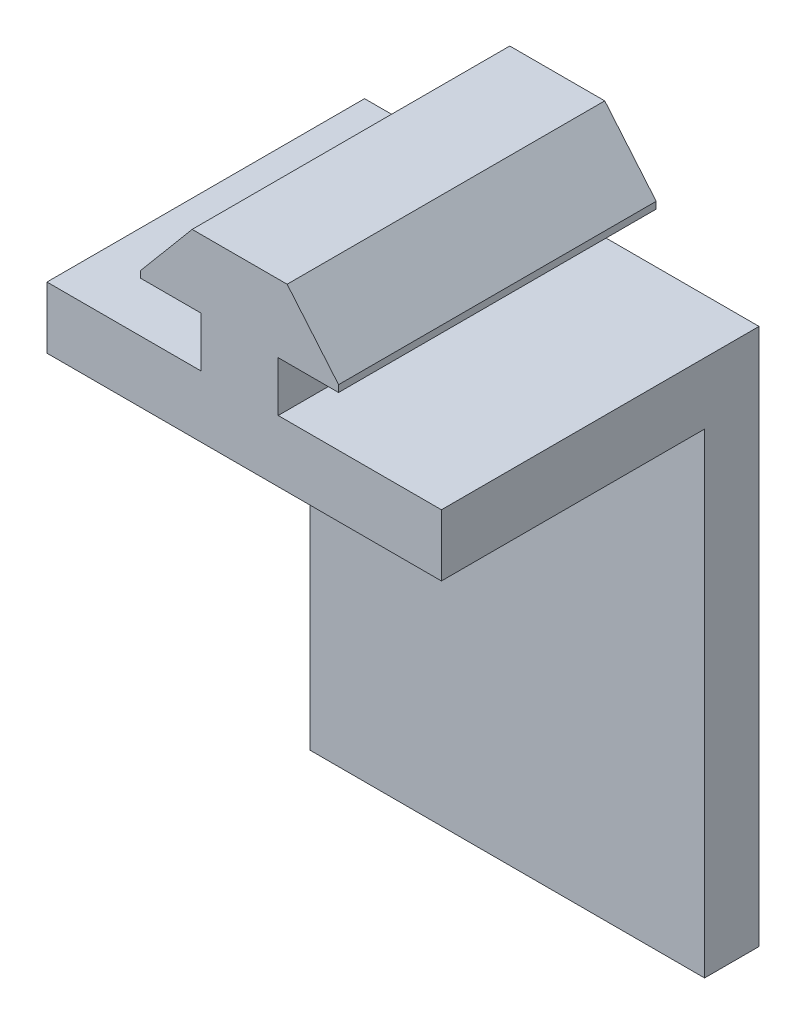
ISO-10303-21;
HEADER;
FILE_DESCRIPTION(('STEP AP214'),'2;1');
FILE_NAME('part.step','',(''),(''),'','','');
FILE_SCHEMA(('AUTOMOTIVE_DESIGN { 1 0 10303 214 1 1 1 1 }'));
ENDSEC;
DATA;
#1=APPLICATION_CONTEXT('core data for automotive mechanical design processes');
#2=APPLICATION_PROTOCOL_DEFINITION('international standard','automotive_design',2000,#1);
#3=PRODUCT_CONTEXT('',#1,'mechanical');
#4=PRODUCT('Part','Part','',(#3));
#5=PRODUCT_RELATED_PRODUCT_CATEGORY('part','',(#4));
#6=PRODUCT_DEFINITION_FORMATION('','',#4);
#7=PRODUCT_DEFINITION_CONTEXT('part definition',#1,'design');
#8=PRODUCT_DEFINITION('design','',#6,#7);
#9=PRODUCT_DEFINITION_SHAPE('','',#8);
#10=(LENGTH_UNIT() NAMED_UNIT(*) SI_UNIT(.MILLI.,.METRE.));
#11=(NAMED_UNIT(*) PLANE_ANGLE_UNIT() SI_UNIT($,.RADIAN.));
#12=(NAMED_UNIT(*) SI_UNIT($,.STERADIAN.) SOLID_ANGLE_UNIT());
#13=UNCERTAINTY_MEASURE_WITH_UNIT(LENGTH_MEASURE(1.E-05),#10,'distance_accuracy_value','');
#14=(GEOMETRIC_REPRESENTATION_CONTEXT(3) GLOBAL_UNCERTAINTY_ASSIGNED_CONTEXT((#13)) GLOBAL_UNIT_ASSIGNED_CONTEXT((#10,
#11,#12)) REPRESENTATION_CONTEXT('',''));
#15=CARTESIAN_POINT('',(0.,0.,0.));
#16=DIRECTION('',(0.,0.,1.));
#17=DIRECTION('',(1.,0.,0.));
#18=AXIS2_PLACEMENT_3D('',#15,#16,#17);
#19=CARTESIAN_POINT('',(19.95,2.794,415.2));
#20=DIRECTION('',(-1.,0.,0.));
#21=DIRECTION('',(0.,-1.,0.));
#22=AXIS2_PLACEMENT_3D('',#19,#20,#21);
#23=PLANE('',#22);
#24=DIRECTION('',(0.,0.,-1.));
#25=VECTOR('',#24,1.);
#26=CARTESIAN_POINT('',(19.95,-37.206,432.8));
#27=LINE('',#26,#25);
#28=CARTESIAN_POINT('',(19.95,-37.206,374.2));
#29=VERTEX_POINT('',#28);
#30=CARTESIAN_POINT('',(19.95,-37.206,342.8));
#31=VERTEX_POINT('',#30);
#32=EDGE_CURVE('E45',#29,#31,#27,.T.);
#33=ORIENTED_EDGE('',*,*,#32,.F.);
#34=DIRECTION('',(0.,-1.,0.));
#35=VECTOR('',#34,1.);
#36=CARTESIAN_POINT('',(19.95,2.794,374.2));
#37=LINE('',#36,#35);
#38=CARTESIAN_POINT('',(19.95,-43.302,374.2));
#39=VERTEX_POINT('',#38);
#40=EDGE_CURVE('E59',#29,#39,#37,.T.);
#41=ORIENTED_EDGE('',*,*,#40,.T.);
#42=DIRECTION('',(0.,0.,-1.));
#43=VECTOR('',#42,1.);
#44=CARTESIAN_POINT('',(19.95,-43.302,457.2));
#45=LINE('',#44,#43);
#46=CARTESIAN_POINT('',(19.95,-43.302,348.186168039582));
#47=VERTEX_POINT('',#46);
#48=EDGE_CURVE('E215',#39,#47,#45,.T.);
#49=ORIENTED_EDGE('',*,*,#48,.T.);
#50=DIRECTION('',(0.,1.,0.));
#51=VECTOR('',#50,1.);
#52=CARTESIAN_POINT('',(19.95,-90.302,348.186168039582));
#53=LINE('',#52,#51);
#54=CARTESIAN_POINT('',(19.95,-90.302,348.186168039582));
#55=VERTEX_POINT('',#54);
#56=EDGE_CURVE('E184',#55,#47,#53,.T.);
#57=ORIENTED_EDGE('',*,*,#56,.F.);
#58=DIRECTION('',(0.,0.,1.));
#59=VECTOR('',#58,1.);
#60=CARTESIAN_POINT('',(19.95,-90.302,348.186168039582));
#61=LINE('',#60,#59);
#62=CARTESIAN_POINT('',(19.95,-90.302,342.8));
#63=VERTEX_POINT('',#62);
#64=EDGE_CURVE('E171',#63,#55,#61,.T.);
#65=ORIENTED_EDGE('',*,*,#64,.F.);
#66=DIRECTION('',(0.,1.,0.));
#67=VECTOR('',#66,1.);
#68=CARTESIAN_POINT('',(19.95,0.,342.8));
#69=LINE('',#68,#67);
#70=EDGE_CURVE('E168',#63,#31,#69,.T.);
#71=ORIENTED_EDGE('',*,*,#70,.T.);
#72=EDGE_LOOP('',(#33,#41,#49,#57,#65,#71));
#73=FACE_BOUND('',#72,.T.);
#74=ADVANCED_FACE('F37',(#73),#23,.F.);
#75=CARTESIAN_POINT('',(-19.05,-43.302,457.2));
#76=DIRECTION('',(0.,-1.,0.));
#77=DIRECTION('',(0.,0.,-1.));
#78=AXIS2_PLACEMENT_3D('',#75,#76,#77);
#79=PLANE('',#78);
#80=DIRECTION('',(-1.,0.,0.));
#81=VECTOR('',#80,1.);
#82=CARTESIAN_POINT('',(-19.05,-43.302,348.186168039582));
#83=LINE('',#82,#81);
#84=CARTESIAN_POINT('',(-19.05,-43.302,348.186168039582));
#85=VERTEX_POINT('',#84);
#86=EDGE_CURVE('E52',#47,#85,#83,.T.);
#87=ORIENTED_EDGE('',*,*,#86,.F.);
#88=ORIENTED_EDGE('',*,*,#48,.F.);
#89=DIRECTION('',(1.,0.,0.));
#90=VECTOR('',#89,1.);
#91=CARTESIAN_POINT('',(-19.05,-43.302,374.2));
#92=LINE('',#91,#90);
#93=CARTESIAN_POINT('',(-19.05,-43.302,374.2));
#94=VERTEX_POINT('',#93);
#95=EDGE_CURVE('E189',#94,#39,#92,.T.);
#96=ORIENTED_EDGE('',*,*,#95,.F.);
#97=DIRECTION('',(0.,0.,-1.));
#98=VECTOR('',#97,1.);
#99=CARTESIAN_POINT('',(-19.05,-43.302,457.2));
#100=LINE('',#99,#98);
#101=EDGE_CURVE('E214',#94,#85,#100,.T.);
#102=ORIENTED_EDGE('',*,*,#101,.T.);
#103=EDGE_LOOP('',(#87,#88,#96,#102));
#104=FACE_BOUND('',#103,.T.);
#105=ADVANCED_FACE('F330',(#104),#79,.T.);
#106=CARTESIAN_POINT('',(-19.05,-43.302,457.2));
#107=DIRECTION('',(-1.,0.,0.));
#108=DIRECTION('',(0.,0.,1.));
#109=AXIS2_PLACEMENT_3D('',#106,#107,#108);
#110=PLANE('',#109);
#111=DIRECTION('',(0.,-1.,0.));
#112=VECTOR('',#111,1.);
#113=CARTESIAN_POINT('',(-19.05,-43.302,374.2));
#114=LINE('',#113,#112);
#115=CARTESIAN_POINT('',(-19.05,-37.206,374.2));
#116=VERTEX_POINT('',#115);
#117=EDGE_CURVE('E187',#116,#94,#114,.T.);
#118=ORIENTED_EDGE('',*,*,#117,.F.);
#119=DIRECTION('',(0.,0.,-1.));
#120=VECTOR('',#119,1.);
#121=CARTESIAN_POINT('',(-19.05,-37.206,457.2));
#122=LINE('',#121,#120);
#123=CARTESIAN_POINT('',(-19.05,-37.206,342.8));
#124=VERTEX_POINT('',#123);
#125=EDGE_CURVE('E158',#116,#124,#122,.T.);
#126=ORIENTED_EDGE('',*,*,#125,.T.);
#127=DIRECTION('',(0.,-1.,0.));
#128=VECTOR('',#127,1.);
#129=CARTESIAN_POINT('',(-19.05,-43.302,342.8));
#130=LINE('',#129,#128);
#131=CARTESIAN_POINT('',(-19.05,-90.302,342.8));
#132=VERTEX_POINT('',#131);
#133=EDGE_CURVE('E150',#124,#132,#130,.T.);
#134=ORIENTED_EDGE('',*,*,#133,.T.);
#135=DIRECTION('',(0.,0.,-1.));
#136=VECTOR('',#135,1.);
#137=CARTESIAN_POINT('',(-19.05,-90.302,348.186168039582));
#138=LINE('',#137,#136);
#139=CARTESIAN_POINT('',(-19.05,-90.302,348.186168039582));
#140=VERTEX_POINT('',#139);
#141=EDGE_CURVE('E156',#140,#132,#138,.T.);
#142=ORIENTED_EDGE('',*,*,#141,.F.);
#143=DIRECTION('',(0.,1.,0.));
#144=VECTOR('',#143,1.);
#145=CARTESIAN_POINT('',(-19.05,-90.302,348.186168039582));
#146=LINE('',#145,#144);
#147=EDGE_CURVE('E181',#140,#85,#146,.T.);
#148=ORIENTED_EDGE('',*,*,#147,.T.);
#149=ORIENTED_EDGE('',*,*,#101,.F.);
#150=EDGE_LOOP('',(#118,#126,#134,#142,#148,#149));
#151=FACE_BOUND('',#150,.T.);
#152=ADVANCED_FACE('F153',(#151),#110,.T.);
#153=CARTESIAN_POINT('',(-19.05,-37.206,457.2));
#154=DIRECTION('',(0.,1.,0.));
#155=DIRECTION('',(0.,0.,1.));
#156=AXIS2_PLACEMENT_3D('',#153,#154,#155);
#157=PLANE('',#156);
#158=DIRECTION('',(-1.,0.,0.));
#159=VECTOR('',#158,1.);
#160=CARTESIAN_POINT('',(-19.05,-37.206,374.2));
#161=LINE('',#160,#159);
#162=CARTESIAN_POINT('',(-3.81,-37.206,374.2));
#163=VERTEX_POINT('',#162);
#164=EDGE_CURVE('E209',#163,#116,#161,.T.);
#165=ORIENTED_EDGE('',*,*,#164,.F.);
#166=DIRECTION('',(0.,0.,-1.));
#167=VECTOR('',#166,1.);
#168=CARTESIAN_POINT('',(-3.81,-37.206,457.2));
#169=LINE('',#168,#167);
#170=CARTESIAN_POINT('',(-3.81,-37.206,342.8));
#171=VERTEX_POINT('',#170);
#172=EDGE_CURVE('E235',#163,#171,#169,.T.);
#173=ORIENTED_EDGE('',*,*,#172,.T.);
#174=DIRECTION('',(-1.,0.,0.));
#175=VECTOR('',#174,1.);
#176=CARTESIAN_POINT('',(-19.05,-37.206,342.8));
#177=LINE('',#176,#175);
#178=EDGE_CURVE('E212',#171,#124,#177,.T.);
#179=ORIENTED_EDGE('',*,*,#178,.T.);
#180=ORIENTED_EDGE('',*,*,#125,.F.);
#181=EDGE_LOOP('',(#165,#173,#179,#180));
#182=FACE_BOUND('',#181,.T.);
#183=ADVANCED_FACE('F322',(#182),#157,.T.);
#184=CARTESIAN_POINT('',(-3.81,-37.206,457.2));
#185=DIRECTION('',(-1.,0.,0.));
#186=DIRECTION('',(0.,0.,1.));
#187=AXIS2_PLACEMENT_3D('',#184,#185,#186);
#188=PLANE('',#187);
#189=DIRECTION('',(0.,-1.,0.));
#190=VECTOR('',#189,1.);
#191=CARTESIAN_POINT('',(-3.81,-37.206,374.2));
#192=LINE('',#191,#190);
#193=CARTESIAN_POINT('',(-3.81,-32.253,374.2));
#194=VERTEX_POINT('',#193);
#195=EDGE_CURVE('E207',#194,#163,#192,.T.);
#196=ORIENTED_EDGE('',*,*,#195,.F.);
#197=DIRECTION('',(0.,0.,-1.));
#198=VECTOR('',#197,1.);
#199=CARTESIAN_POINT('',(-3.81,-32.253,457.2));
#200=LINE('',#199,#198);
#201=CARTESIAN_POINT('',(-3.81,-32.253,342.8));
#202=VERTEX_POINT('',#201);
#203=EDGE_CURVE('E233',#194,#202,#200,.T.);
#204=ORIENTED_EDGE('',*,*,#203,.T.);
#205=DIRECTION('',(0.,-1.,0.));
#206=VECTOR('',#205,1.);
#207=CARTESIAN_POINT('',(-3.81,-37.206,342.8));
#208=LINE('',#207,#206);
#209=EDGE_CURVE('E264',#202,#171,#208,.T.);
#210=ORIENTED_EDGE('',*,*,#209,.T.);
#211=ORIENTED_EDGE('',*,*,#172,.F.);
#212=EDGE_LOOP('',(#196,#204,#210,#211));
#213=FACE_BOUND('',#212,.T.);
#214=ADVANCED_FACE('F319',(#213),#188,.T.);
#215=CARTESIAN_POINT('',(-3.81,-32.253,457.2));
#216=DIRECTION('',(0.,-1.,0.));
#217=DIRECTION('',(1.,0.,0.));
#218=AXIS2_PLACEMENT_3D('',#215,#216,#217);
#219=PLANE('',#218);
#220=DIRECTION('',(1.,0.,0.));
#221=VECTOR('',#220,1.);
#222=CARTESIAN_POINT('',(-3.81,-32.253,374.2));
#223=LINE('',#222,#221);
#224=CARTESIAN_POINT('',(-9.779,-32.253,374.2));
#225=VERTEX_POINT('',#224);
#226=EDGE_CURVE('E205',#225,#194,#223,.T.);
#227=ORIENTED_EDGE('',*,*,#226,.F.);
#228=DIRECTION('',(0.,0.,-1.));
#229=VECTOR('',#228,1.);
#230=CARTESIAN_POINT('',(-9.779,-32.253,457.2));
#231=LINE('',#230,#229);
#232=CARTESIAN_POINT('',(-9.779,-32.253,342.8));
#233=VERTEX_POINT('',#232);
#234=EDGE_CURVE('E231',#225,#233,#231,.T.);
#235=ORIENTED_EDGE('',*,*,#234,.T.);
#236=DIRECTION('',(1.,0.,0.));
#237=VECTOR('',#236,1.);
#238=CARTESIAN_POINT('',(-3.81,-32.253,342.8));
#239=LINE('',#238,#237);
#240=EDGE_CURVE('E261',#233,#202,#239,.T.);
#241=ORIENTED_EDGE('',*,*,#240,.T.);
#242=ORIENTED_EDGE('',*,*,#203,.F.);
#243=EDGE_LOOP('',(#227,#235,#241,#242));
#244=FACE_BOUND('',#243,.T.);
#245=ADVANCED_FACE('F313',(#244),#219,.T.);
#246=CARTESIAN_POINT('',(-9.779,-32.253,457.2));
#247=DIRECTION('',(-1.,0.,0.));
#248=DIRECTION('',(0.,0.,1.));
#249=AXIS2_PLACEMENT_3D('',#246,#247,#248);
#250=PLANE('',#249);
#251=DIRECTION('',(0.,-1.,0.));
#252=VECTOR('',#251,1.);
#253=CARTESIAN_POINT('',(-9.779,-32.253,374.2));
#254=LINE('',#253,#252);
#255=CARTESIAN_POINT('',(-9.779,-31.5799,374.2));
#256=VERTEX_POINT('',#255);
#257=EDGE_CURVE('E203',#256,#225,#254,.T.);
#258=ORIENTED_EDGE('',*,*,#257,.F.);
#259=DIRECTION('',(0.,0.,-1.));
#260=VECTOR('',#259,1.);
#261=CARTESIAN_POINT('',(-9.779,-31.5799,457.2));
#262=LINE('',#261,#260);
#263=CARTESIAN_POINT('',(-9.779,-31.5799,342.8));
#264=VERTEX_POINT('',#263);
#265=EDGE_CURVE('E229',#256,#264,#262,.T.);
#266=ORIENTED_EDGE('',*,*,#265,.T.);
#267=DIRECTION('',(0.,-1.,0.));
#268=VECTOR('',#267,1.);
#269=CARTESIAN_POINT('',(-9.779,-32.253,342.8));
#270=LINE('',#269,#268);
#271=EDGE_CURVE('E258',#264,#233,#270,.T.);
#272=ORIENTED_EDGE('',*,*,#271,.T.);
#273=ORIENTED_EDGE('',*,*,#234,.F.);
#274=EDGE_LOOP('',(#258,#266,#272,#273));
#275=FACE_BOUND('',#274,.T.);
#276=ADVANCED_FACE('F311',(#275),#250,.T.);
#277=CARTESIAN_POINT('',(-9.779,-31.5799,457.2));
#278=DIRECTION('',(-0.766044443118979,0.642787609686538,0.));
#279=DIRECTION('',(-0.642787609686538,-0.766044443118979,0.));
#280=AXIS2_PLACEMENT_3D('',#277,#278,#279);
#281=PLANE('',#280);
#282=DIRECTION('',(-0.642787609686538,-0.766044443118979,0.));
#283=VECTOR('',#282,1.);
#284=CARTESIAN_POINT('',(-9.779,-31.5799,374.2));
#285=LINE('',#284,#283);
#286=CARTESIAN_POINT('',(-4.69581834429117,-25.522,374.2));
#287=VERTEX_POINT('',#286);
#288=EDGE_CURVE('E201',#287,#256,#285,.T.);
#289=ORIENTED_EDGE('',*,*,#288,.F.);
#290=DIRECTION('',(0.,0.,-1.));
#291=VECTOR('',#290,1.);
#292=CARTESIAN_POINT('',(-4.69581834429117,-25.522,457.2));
#293=LINE('',#292,#291);
#294=CARTESIAN_POINT('',(-4.69581834429117,-25.522,342.8));
#295=VERTEX_POINT('',#294);
#296=EDGE_CURVE('E227',#287,#295,#293,.T.);
#297=ORIENTED_EDGE('',*,*,#296,.T.);
#298=DIRECTION('',(-0.642787609686538,-0.766044443118979,0.));
#299=VECTOR('',#298,1.);
#300=CARTESIAN_POINT('',(-9.779,-31.5799,342.8));
#301=LINE('',#300,#299);
#302=EDGE_CURVE('E255',#295,#264,#301,.T.);
#303=ORIENTED_EDGE('',*,*,#302,.T.);
#304=ORIENTED_EDGE('',*,*,#265,.F.);
#305=EDGE_LOOP('',(#289,#297,#303,#304));
#306=FACE_BOUND('',#305,.T.);
#307=ADVANCED_FACE('F306',(#306),#281,.T.);
#308=CARTESIAN_POINT('',(-4.69581834429117,-25.522,457.2));
#309=DIRECTION('',(0.,1.,0.));
#310=DIRECTION('',(0.,0.,1.));
#311=AXIS2_PLACEMENT_3D('',#308,#309,#310);
#312=PLANE('',#311);
#313=DIRECTION('',(-1.,0.,0.));
#314=VECTOR('',#313,1.);
#315=CARTESIAN_POINT('',(-4.69581834429117,-25.522,374.2));
#316=LINE('',#315,#314);
#317=CARTESIAN_POINT('',(4.69581834429117,-25.522,374.2));
#318=VERTEX_POINT('',#317);
#319=EDGE_CURVE('E199',#318,#287,#316,.T.);
#320=ORIENTED_EDGE('',*,*,#319,.F.);
#321=DIRECTION('',(0.,0.,-1.));
#322=VECTOR('',#321,1.);
#323=CARTESIAN_POINT('',(4.69581834429117,-25.522,457.2));
#324=LINE('',#323,#322);
#325=CARTESIAN_POINT('',(4.69581834429117,-25.522,342.8));
#326=VERTEX_POINT('',#325);
#327=EDGE_CURVE('E225',#318,#326,#324,.T.);
#328=ORIENTED_EDGE('',*,*,#327,.T.);
#329=DIRECTION('',(-1.,0.,0.));
#330=VECTOR('',#329,1.);
#331=CARTESIAN_POINT('',(-4.69581834429117,-25.522,342.8));
#332=LINE('',#331,#330);
#333=EDGE_CURVE('E252',#326,#295,#332,.T.);
#334=ORIENTED_EDGE('',*,*,#333,.T.);
#335=ORIENTED_EDGE('',*,*,#296,.F.);
#336=EDGE_LOOP('',(#320,#328,#334,#335));
#337=FACE_BOUND('',#336,.T.);
#338=ADVANCED_FACE('F298',(#337),#312,.T.);
#339=CARTESIAN_POINT('',(4.69581834429117,-25.522,457.2));
#340=DIRECTION('',(0.766044443118979,0.642787609686538,0.));
#341=DIRECTION('',(-0.642787609686538,0.766044443118979,0.));
#342=AXIS2_PLACEMENT_3D('',#339,#340,#341);
#343=PLANE('',#342);
#344=DIRECTION('',(-0.642787609686538,0.766044443118979,0.));
#345=VECTOR('',#344,1.);
#346=CARTESIAN_POINT('',(4.69581834429117,-25.522,374.2));
#347=LINE('',#346,#345);
#348=CARTESIAN_POINT('',(9.779,-31.5799,374.2));
#349=VERTEX_POINT('',#348);
#350=EDGE_CURVE('E197',#349,#318,#347,.T.);
#351=ORIENTED_EDGE('',*,*,#350,.F.);
#352=DIRECTION('',(0.,0.,-1.));
#353=VECTOR('',#352,1.);
#354=CARTESIAN_POINT('',(9.779,-31.5799,457.2));
#355=LINE('',#354,#353);
#356=CARTESIAN_POINT('',(9.779,-31.5799,342.8));
#357=VERTEX_POINT('',#356);
#358=EDGE_CURVE('E223',#349,#357,#355,.T.);
#359=ORIENTED_EDGE('',*,*,#358,.T.);
#360=DIRECTION('',(-0.642787609686538,0.766044443118979,0.));
#361=VECTOR('',#360,1.);
#362=CARTESIAN_POINT('',(4.69581834429117,-25.522,342.8));
#363=LINE('',#362,#361);
#364=EDGE_CURVE('E249',#357,#326,#363,.T.);
#365=ORIENTED_EDGE('',*,*,#364,.T.);
#366=ORIENTED_EDGE('',*,*,#327,.F.);
#367=EDGE_LOOP('',(#351,#359,#365,#366));
#368=FACE_BOUND('',#367,.T.);
#369=ADVANCED_FACE('F296',(#368),#343,.T.);
#370=CARTESIAN_POINT('',(9.779,-31.5799,457.2));
#371=DIRECTION('',(1.,0.,0.));
#372=DIRECTION('',(0.,0.,-1.));
#373=AXIS2_PLACEMENT_3D('',#370,#371,#372);
#374=PLANE('',#373);
#375=DIRECTION('',(0.,1.,0.));
#376=VECTOR('',#375,1.);
#377=CARTESIAN_POINT('',(9.779,-31.5799,374.2));
#378=LINE('',#377,#376);
#379=CARTESIAN_POINT('',(9.779,-32.253,374.2));
#380=VERTEX_POINT('',#379);
#381=EDGE_CURVE('E195',#380,#349,#378,.T.);
#382=ORIENTED_EDGE('',*,*,#381,.F.);
#383=DIRECTION('',(0.,0.,-1.));
#384=VECTOR('',#383,1.);
#385=CARTESIAN_POINT('',(9.779,-32.253,457.2));
#386=LINE('',#385,#384);
#387=CARTESIAN_POINT('',(9.779,-32.253,342.8));
#388=VERTEX_POINT('',#387);
#389=EDGE_CURVE('E221',#380,#388,#386,.T.);
#390=ORIENTED_EDGE('',*,*,#389,.T.);
#391=DIRECTION('',(0.,1.,0.));
#392=VECTOR('',#391,1.);
#393=CARTESIAN_POINT('',(9.779,-31.5799,342.8));
#394=LINE('',#393,#392);
#395=EDGE_CURVE('E246',#388,#357,#394,.T.);
#396=ORIENTED_EDGE('',*,*,#395,.T.);
#397=ORIENTED_EDGE('',*,*,#358,.F.);
#398=EDGE_LOOP('',(#382,#390,#396,#397));
#399=FACE_BOUND('',#398,.T.);
#400=ADVANCED_FACE('F291',(#399),#374,.T.);
#401=CARTESIAN_POINT('',(3.81,-32.253,457.2));
#402=DIRECTION('',(0.,-1.,0.));
#403=DIRECTION('',(1.,0.,0.));
#404=AXIS2_PLACEMENT_3D('',#401,#402,#403);
#405=PLANE('',#404);
#406=DIRECTION('',(1.,0.,0.));
#407=VECTOR('',#406,1.);
#408=CARTESIAN_POINT('',(3.81,-32.253,374.2));
#409=LINE('',#408,#407);
#410=CARTESIAN_POINT('',(3.81,-32.253,374.2));
#411=VERTEX_POINT('',#410);
#412=EDGE_CURVE('E193',#411,#380,#409,.T.);
#413=ORIENTED_EDGE('',*,*,#412,.F.);
#414=DIRECTION('',(0.,0.,-1.));
#415=VECTOR('',#414,1.);
#416=CARTESIAN_POINT('',(3.81,-32.253,457.2));
#417=LINE('',#416,#415);
#418=CARTESIAN_POINT('',(3.81,-32.253,342.8));
#419=VERTEX_POINT('',#418);
#420=EDGE_CURVE('E219',#411,#419,#417,.T.);
#421=ORIENTED_EDGE('',*,*,#420,.T.);
#422=DIRECTION('',(1.,0.,0.));
#423=VECTOR('',#422,1.);
#424=CARTESIAN_POINT('',(3.81,-32.253,342.8));
#425=LINE('',#424,#423);
#426=EDGE_CURVE('E243',#419,#388,#425,.T.);
#427=ORIENTED_EDGE('',*,*,#426,.T.);
#428=ORIENTED_EDGE('',*,*,#389,.F.);
#429=EDGE_LOOP('',(#413,#421,#427,#428));
#430=FACE_BOUND('',#429,.T.);
#431=ADVANCED_FACE('F283',(#430),#405,.T.);
#432=CARTESIAN_POINT('',(0.,0.,342.8));
#433=DIRECTION('',(0.,0.,-1.));
#434=DIRECTION('',(-1.,0.,0.));
#435=AXIS2_PLACEMENT_3D('',#432,#433,#434);
#436=PLANE('',#435);
#437=ORIENTED_EDGE('',*,*,#70,.F.);
#438=DIRECTION('',(1.,0.,0.));
#439=VECTOR('',#438,1.);
#440=CARTESIAN_POINT('',(-19.05,-90.302,342.8));
#441=LINE('',#440,#439);
#442=EDGE_CURVE('E165',#132,#63,#441,.T.);
#443=ORIENTED_EDGE('',*,*,#442,.F.);
#444=ORIENTED_EDGE('',*,*,#133,.F.);
#445=ORIENTED_EDGE('',*,*,#178,.F.);
#446=ORIENTED_EDGE('',*,*,#209,.F.);
#447=ORIENTED_EDGE('',*,*,#240,.F.);
#448=ORIENTED_EDGE('',*,*,#271,.F.);
#449=ORIENTED_EDGE('',*,*,#302,.F.);
#450=ORIENTED_EDGE('',*,*,#333,.F.);
#451=ORIENTED_EDGE('',*,*,#364,.F.);
#452=ORIENTED_EDGE('',*,*,#395,.F.);
#453=ORIENTED_EDGE('',*,*,#426,.F.);
#454=DIRECTION('',(0.,1.,0.));
#455=VECTOR('',#454,1.);
#456=CARTESIAN_POINT('',(3.81,-37.206,342.8));
#457=LINE('',#456,#455);
#458=CARTESIAN_POINT('',(3.81,-37.206,342.8));
#459=VERTEX_POINT('',#458);
#460=EDGE_CURVE('E240',#459,#419,#457,.T.);
#461=ORIENTED_EDGE('',*,*,#460,.F.);
#462=DIRECTION('',(-1.,0.,0.));
#463=VECTOR('',#462,1.);
#464=CARTESIAN_POINT('',(19.05,-37.206,342.8));
#465=LINE('',#464,#463);
#466=EDGE_CURVE('E162',#31,#459,#465,.T.);
#467=ORIENTED_EDGE('',*,*,#466,.F.);
#468=EDGE_LOOP('',(#437,#443,#444,#445,#446,#447,#448,#449,#450,#451,#452,#453,#461,#467));
#469=FACE_BOUND('',#468,.T.);
#470=ADVANCED_FACE('F39',(#469),#436,.T.);
#471=CARTESIAN_POINT('',(3.81,-37.206,457.2));
#472=DIRECTION('',(1.,0.,0.));
#473=DIRECTION('',(0.,0.,-1.));
#474=AXIS2_PLACEMENT_3D('',#471,#472,#473);
#475=PLANE('',#474);
#476=DIRECTION('',(0.,1.,0.));
#477=VECTOR('',#476,1.);
#478=CARTESIAN_POINT('',(3.81,-37.206,374.2));
#479=LINE('',#478,#477);
#480=CARTESIAN_POINT('',(3.81,-37.206,374.2));
#481=VERTEX_POINT('',#480);
#482=EDGE_CURVE('E191',#481,#411,#479,.T.);
#483=ORIENTED_EDGE('',*,*,#482,.F.);
#484=DIRECTION('',(0.,0.,-1.));
#485=VECTOR('',#484,1.);
#486=CARTESIAN_POINT('',(3.81,-37.206,457.2));
#487=LINE('',#486,#485);
#488=EDGE_CURVE('E217',#481,#459,#487,.T.);
#489=ORIENTED_EDGE('',*,*,#488,.T.);
#490=ORIENTED_EDGE('',*,*,#460,.T.);
#491=ORIENTED_EDGE('',*,*,#420,.F.);
#492=EDGE_LOOP('',(#483,#489,#490,#491));
#493=FACE_BOUND('',#492,.T.);
#494=ADVANCED_FACE('F281',(#493),#475,.T.);
#495=CARTESIAN_POINT('',(19.05,-37.206,457.2));
#496=DIRECTION('',(0.,1.,0.));
#497=DIRECTION('',(0.,0.,1.));
#498=AXIS2_PLACEMENT_3D('',#495,#496,#497);
#499=PLANE('',#498);
#500=DIRECTION('',(-1.,0.,0.));
#501=VECTOR('',#500,1.);
#502=CARTESIAN_POINT('',(19.05,-37.206,374.2));
#503=LINE('',#502,#501);
#504=EDGE_CURVE('E11',#29,#481,#503,.T.);
#505=ORIENTED_EDGE('',*,*,#504,.F.);
#506=ORIENTED_EDGE('',*,*,#32,.T.);
#507=ORIENTED_EDGE('',*,*,#466,.T.);
#508=ORIENTED_EDGE('',*,*,#488,.F.);
#509=EDGE_LOOP('',(#505,#506,#507,#508));
#510=FACE_BOUND('',#509,.T.);
#511=ADVANCED_FACE('F275',(#510),#499,.T.);
#512=CARTESIAN_POINT('',(0.,0.,374.2));
#513=DIRECTION('',(0.,0.,-1.));
#514=DIRECTION('',(-1.,0.,0.));
#515=AXIS2_PLACEMENT_3D('',#512,#513,#514);
#516=PLANE('',#515);
#517=ORIENTED_EDGE('',*,*,#504,.T.);
#518=ORIENTED_EDGE('',*,*,#482,.T.);
#519=ORIENTED_EDGE('',*,*,#412,.T.);
#520=ORIENTED_EDGE('',*,*,#381,.T.);
#521=ORIENTED_EDGE('',*,*,#350,.T.);
#522=ORIENTED_EDGE('',*,*,#319,.T.);
#523=ORIENTED_EDGE('',*,*,#288,.T.);
#524=ORIENTED_EDGE('',*,*,#257,.T.);
#525=ORIENTED_EDGE('',*,*,#226,.T.);
#526=ORIENTED_EDGE('',*,*,#195,.T.);
#527=ORIENTED_EDGE('',*,*,#164,.T.);
#528=ORIENTED_EDGE('',*,*,#117,.T.);
#529=ORIENTED_EDGE('',*,*,#95,.T.);
#530=ORIENTED_EDGE('',*,*,#40,.F.);
#531=EDGE_LOOP('',(#517,#518,#519,#520,#521,#522,#523,#524,#525,#526,#527,#528,#529,#530));
#532=FACE_BOUND('',#531,.T.);
#533=ADVANCED_FACE('F277',(#532),#516,.F.);
#534=CARTESIAN_POINT('',(-19.05,-90.302,348.186168039582));
#535=DIRECTION('',(0.,0.,-1.));
#536=DIRECTION('',(-1.,0.,0.));
#537=AXIS2_PLACEMENT_3D('',#534,#535,#536);
#538=PLANE('',#537);
#539=ORIENTED_EDGE('',*,*,#86,.T.);
#540=ORIENTED_EDGE('',*,*,#147,.F.);
#541=DIRECTION('',(-1.,0.,0.));
#542=VECTOR('',#541,1.);
#543=CARTESIAN_POINT('',(-19.05,-90.302,348.186168039582));
#544=LINE('',#543,#542);
#545=EDGE_CURVE('E175',#55,#140,#544,.T.);
#546=ORIENTED_EDGE('',*,*,#545,.F.);
#547=ORIENTED_EDGE('',*,*,#56,.T.);
#548=EDGE_LOOP('',(#539,#540,#546,#547));
#549=FACE_BOUND('',#548,.T.);
#550=ADVANCED_FACE('F344',(#549),#538,.F.);
#551=CARTESIAN_POINT('',(0.,-90.302,0.));
#552=DIRECTION('',(0.,-1.,0.));
#553=DIRECTION('',(0.,0.,-1.));
#554=AXIS2_PLACEMENT_3D('',#551,#552,#553);
#555=PLANE('',#554);
#556=ORIENTED_EDGE('',*,*,#141,.T.);
#557=ORIENTED_EDGE('',*,*,#442,.T.);
#558=ORIENTED_EDGE('',*,*,#64,.T.);
#559=ORIENTED_EDGE('',*,*,#545,.T.);
#560=EDGE_LOOP('',(#556,#557,#558,#559));
#561=FACE_BOUND('',#560,.T.);
#562=ADVANCED_FACE('F173',(#561),#555,.T.);
#563=CLOSED_SHELL('',(#74,#105,#152,#183,#214,#245,#276,#307,#338,#369,#400,#431,#470,#494,#511,
#533,#550,#562));
#564=MANIFOLD_SOLID_BREP('B2',#563);
#565=ADVANCED_BREP_SHAPE_REPRESENTATION('',(#18,#564),#14);
#566=SHAPE_DEFINITION_REPRESENTATION(#9,#565);
ENDSEC;
END-ISO-10303-21;
